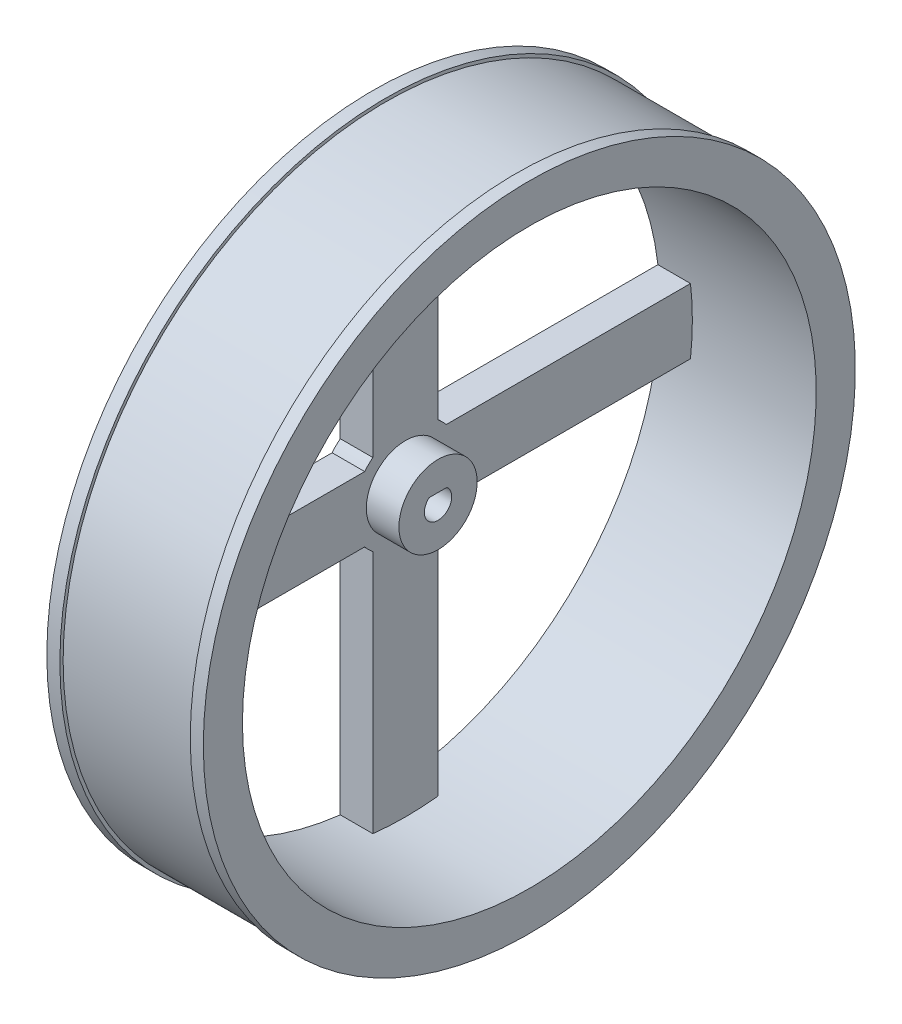
ISO-10303-21;
HEADER;
FILE_DESCRIPTION(('STEP AP214'),'2;1');
FILE_NAME('part.step','',(''),(''),'','','');
FILE_SCHEMA(('AUTOMOTIVE_DESIGN { 1 0 10303 214 1 1 1 1 }'));
ENDSEC;
DATA;
#1=APPLICATION_CONTEXT('core data for automotive mechanical design processes');
#2=APPLICATION_PROTOCOL_DEFINITION('international standard','automotive_design',2000,#1);
#3=PRODUCT_CONTEXT('',#1,'mechanical');
#4=PRODUCT('Part','Part','',(#3));
#5=PRODUCT_RELATED_PRODUCT_CATEGORY('part','',(#4));
#6=PRODUCT_DEFINITION_FORMATION('','',#4);
#7=PRODUCT_DEFINITION_CONTEXT('part definition',#1,'design');
#8=PRODUCT_DEFINITION('design','',#6,#7);
#9=PRODUCT_DEFINITION_SHAPE('','',#8);
#10=(LENGTH_UNIT() NAMED_UNIT(*) SI_UNIT(.MILLI.,.METRE.));
#11=(NAMED_UNIT(*) PLANE_ANGLE_UNIT() SI_UNIT($,.RADIAN.));
#12=(NAMED_UNIT(*) SI_UNIT($,.STERADIAN.) SOLID_ANGLE_UNIT());
#13=UNCERTAINTY_MEASURE_WITH_UNIT(LENGTH_MEASURE(1.E-05),#10,'distance_accuracy_value','');
#14=(GEOMETRIC_REPRESENTATION_CONTEXT(3) GLOBAL_UNCERTAINTY_ASSIGNED_CONTEXT((#13)) GLOBAL_UNIT_ASSIGNED_CONTEXT((#10,
#11,#12)) REPRESENTATION_CONTEXT('',''));
#15=CARTESIAN_POINT('',(0.,0.,0.));
#16=DIRECTION('',(0.,0.,1.));
#17=DIRECTION('',(1.,0.,0.));
#18=AXIS2_PLACEMENT_3D('',#15,#16,#17);
#19=CARTESIAN_POINT('',(0.,0.,0.));
#20=DIRECTION('',(-1.,0.,0.));
#21=DIRECTION('',(0.,0.,1.));
#22=AXIS2_PLACEMENT_3D('',#19,#20,#21);
#23=CYLINDRICAL_SURFACE('',#22,44.);
#24=CARTESIAN_POINT('',(12.,0.,0.));
#25=DIRECTION('',(-1.,0.,0.));
#26=DIRECTION('',(0.,0.,1.));
#27=AXIS2_PLACEMENT_3D('',#24,#25,#26);
#28=CIRCLE('',#27,44.);
#29=CARTESIAN_POINT('',(12.,0.,44.));
#30=VERTEX_POINT('',#29);
#31=EDGE_CURVE('E184',#30,#30,#28,.T.);
#32=ORIENTED_EDGE('',*,*,#31,.F.);
#33=EDGE_LOOP('',(#32));
#34=FACE_BOUND('',#33,.T.);
#35=DIRECTION('',(-1.,0.,0.));
#36=VECTOR('',#35,1.);
#37=CARTESIAN_POINT('',(-7.,-5.00000000000015,-43.7149859887888));
#38=LINE('',#37,#36);
#39=CARTESIAN_POINT('',(-7.,-5.00000000000015,-43.7149859887888));
#40=VERTEX_POINT('',#39);
#41=CARTESIAN_POINT('',(-12.,-5.00000000000015,-43.7149859887888));
#42=VERTEX_POINT('',#41);
#43=EDGE_CURVE('E277',#40,#42,#38,.T.);
#44=ORIENTED_EDGE('',*,*,#43,.T.);
#45=CARTESIAN_POINT('',(-12.,0.,0.));
#46=DIRECTION('',(-1.,0.,0.));
#47=DIRECTION('',(0.,0.,1.));
#48=AXIS2_PLACEMENT_3D('',#45,#46,#47);
#49=CIRCLE('',#48,44.);
#50=CARTESIAN_POINT('',(-12.,-43.7149859887888,-5.));
#51=VERTEX_POINT('',#50);
#52=EDGE_CURVE('E372',#42,#51,#49,.T.);
#53=ORIENTED_EDGE('',*,*,#52,.T.);
#54=DIRECTION('',(-1.,0.,0.));
#55=VECTOR('',#54,1.);
#56=CARTESIAN_POINT('',(-7.,-43.7149859887888,-5.));
#57=LINE('',#56,#55);
#58=CARTESIAN_POINT('',(-7.,-43.7149859887888,-5.));
#59=VERTEX_POINT('',#58);
#60=EDGE_CURVE('E243',#59,#51,#57,.T.);
#61=ORIENTED_EDGE('',*,*,#60,.F.);
#62=CARTESIAN_POINT('',(-7.,0.,0.));
#63=DIRECTION('',(1.,0.,0.));
#64=DIRECTION('',(0.,0.,-1.));
#65=AXIS2_PLACEMENT_3D('',#62,#63,#64);
#66=CIRCLE('',#65,44.);
#67=CARTESIAN_POINT('',(-7.,-43.7149859887888,5.));
#68=VERTEX_POINT('',#67);
#69=EDGE_CURVE('E225',#68,#59,#66,.T.);
#70=ORIENTED_EDGE('',*,*,#69,.F.);
#71=DIRECTION('',(-1.,0.,0.));
#72=VECTOR('',#71,1.);
#73=CARTESIAN_POINT('',(-7.,-43.7149859887888,4.99999999999999));
#74=LINE('',#73,#72);
#75=CARTESIAN_POINT('',(-12.,-43.7149859887888,4.99999999999999));
#76=VERTEX_POINT('',#75);
#77=EDGE_CURVE('E247',#68,#76,#74,.T.);
#78=ORIENTED_EDGE('',*,*,#77,.T.);
#79=CARTESIAN_POINT('',(-12.,-4.99999999999954,43.7149859887888));
#80=VERTEX_POINT('',#79);
#81=EDGE_CURVE('E183',#76,#80,#49,.T.);
#82=ORIENTED_EDGE('',*,*,#81,.T.);
#83=DIRECTION('',(-1.,0.,0.));
#84=VECTOR('',#83,1.);
#85=CARTESIAN_POINT('',(-7.,-4.99999999999955,43.7149859887888));
#86=LINE('',#85,#84);
#87=CARTESIAN_POINT('',(-7.,-4.99999999999955,43.7149859887888));
#88=VERTEX_POINT('',#87);
#89=EDGE_CURVE('E196',#88,#80,#86,.T.);
#90=ORIENTED_EDGE('',*,*,#89,.F.);
#91=CARTESIAN_POINT('',(-7.,0.,0.));
#92=DIRECTION('',(1.,0.,0.));
#93=DIRECTION('',(0.,-1.,0.));
#94=AXIS2_PLACEMENT_3D('',#91,#92,#93);
#95=CIRCLE('',#94,44.);
#96=CARTESIAN_POINT('',(-7.,5.00000000000045,43.7149859887887));
#97=VERTEX_POINT('',#96);
#98=EDGE_CURVE('E190',#97,#88,#95,.T.);
#99=ORIENTED_EDGE('',*,*,#98,.F.);
#100=DIRECTION('',(-1.,0.,0.));
#101=VECTOR('',#100,1.);
#102=CARTESIAN_POINT('',(-7.,5.00000000000045,43.7149859887887));
#103=LINE('',#102,#101);
#104=CARTESIAN_POINT('',(-12.,5.00000000000045,43.7149859887887));
#105=VERTEX_POINT('',#104);
#106=EDGE_CURVE('E188',#97,#105,#103,.T.);
#107=ORIENTED_EDGE('',*,*,#106,.T.);
#108=CARTESIAN_POINT('',(-12.,43.7149859887888,5.));
#109=VERTEX_POINT('',#108);
#110=EDGE_CURVE('E172',#105,#109,#49,.T.);
#111=ORIENTED_EDGE('',*,*,#110,.T.);
#112=DIRECTION('',(-1.,0.,0.));
#113=VECTOR('',#112,1.);
#114=CARTESIAN_POINT('',(-7.,43.7149859887888,5.));
#115=LINE('',#114,#113);
#116=CARTESIAN_POINT('',(-7.,43.7149859887888,5.));
#117=VERTEX_POINT('',#116);
#118=EDGE_CURVE('E338',#117,#109,#115,.T.);
#119=ORIENTED_EDGE('',*,*,#118,.F.);
#120=CARTESIAN_POINT('',(-7.,0.,0.));
#121=DIRECTION('',(1.,0.,0.));
#122=DIRECTION('',(0.,0.,1.));
#123=AXIS2_PLACEMENT_3D('',#120,#121,#122);
#124=CIRCLE('',#123,44.);
#125=CARTESIAN_POINT('',(-7.,43.7149859887888,-5.));
#126=VERTEX_POINT('',#125);
#127=EDGE_CURVE('E317',#126,#117,#124,.T.);
#128=ORIENTED_EDGE('',*,*,#127,.F.);
#129=DIRECTION('',(-1.,0.,0.));
#130=VECTOR('',#129,1.);
#131=CARTESIAN_POINT('',(-7.,43.7149859887888,-4.99999999999999));
#132=LINE('',#131,#130);
#133=CARTESIAN_POINT('',(-12.,43.7149859887888,-5.));
#134=VERTEX_POINT('',#133);
#135=EDGE_CURVE('E341',#126,#134,#132,.T.);
#136=ORIENTED_EDGE('',*,*,#135,.T.);
#137=CARTESIAN_POINT('',(-12.,4.99999999999985,-43.7149859887888));
#138=VERTEX_POINT('',#137);
#139=EDGE_CURVE('E186',#134,#138,#49,.T.);
#140=ORIENTED_EDGE('',*,*,#139,.T.);
#141=DIRECTION('',(-1.,0.,0.));
#142=VECTOR('',#141,1.);
#143=CARTESIAN_POINT('',(-7.,4.99999999999985,-43.7149859887888));
#144=LINE('',#143,#142);
#145=CARTESIAN_POINT('',(-7.,4.99999999999985,-43.7149859887888));
#146=VERTEX_POINT('',#145);
#147=EDGE_CURVE('E68',#146,#138,#144,.T.);
#148=ORIENTED_EDGE('',*,*,#147,.F.);
#149=CARTESIAN_POINT('',(-7.,0.,0.));
#150=DIRECTION('',(1.,0.,0.));
#151=DIRECTION('',(0.,1.,0.));
#152=AXIS2_PLACEMENT_3D('',#149,#150,#151);
#153=CIRCLE('',#152,44.);
#154=EDGE_CURVE('E63',#40,#146,#153,.T.);
#155=ORIENTED_EDGE('',*,*,#154,.F.);
#156=EDGE_LOOP('',(#44,#53,#61,#70,#78,#82,#90,#99,#107,#111,#119,#128,#136,#140,#148,#155));
#157=FACE_BOUND('',#156,.T.);
#158=ADVANCED_FACE('F47',(#34,#157),#23,.F.);
#159=CARTESIAN_POINT('',(-7.,0.,0.));
#160=DIRECTION('',(-1.,0.,0.));
#161=DIRECTION('',(0.,0.,1.));
#162=AXIS2_PLACEMENT_3D('',#159,#160,#161);
#163=CYLINDRICAL_SURFACE('',#162,8.);
#164=DIRECTION('',(-1.,0.,0.));
#165=VECTOR('',#164,1.);
#166=CARTESIAN_POINT('',(-7.,-5.00000000000002,-6.24499799839838));
#167=LINE('',#166,#165);
#168=CARTESIAN_POINT('',(-7.,-5.00000000000002,-6.24499799839838));
#169=VERTEX_POINT('',#168);
#170=CARTESIAN_POINT('',(-12.,-5.00000000000002,-6.24499799839838));
#171=VERTEX_POINT('',#170);
#172=EDGE_CURVE('E280',#169,#171,#167,.T.);
#173=ORIENTED_EDGE('',*,*,#172,.F.);
#174=CARTESIAN_POINT('',(-7.,0.,0.));
#175=DIRECTION('',(1.,0.,0.));
#176=DIRECTION('',(0.,0.,-1.));
#177=AXIS2_PLACEMENT_3D('',#174,#175,#176);
#178=CIRCLE('',#177,8.);
#179=CARTESIAN_POINT('',(-7.,-6.2449979983984,-5.));
#180=VERTEX_POINT('',#179);
#181=EDGE_CURVE('E512',#180,#169,#178,.T.);
#182=ORIENTED_EDGE('',*,*,#181,.F.);
#183=DIRECTION('',(-1.,0.,0.));
#184=VECTOR('',#183,1.);
#185=CARTESIAN_POINT('',(-7.,-6.2449979983984,-5.));
#186=LINE('',#185,#184);
#187=CARTESIAN_POINT('',(-12.,-6.2449979983984,-5.));
#188=VERTEX_POINT('',#187);
#189=EDGE_CURVE('E234',#180,#188,#186,.T.);
#190=ORIENTED_EDGE('',*,*,#189,.T.);
#191=CARTESIAN_POINT('',(-12.,0.,0.));
#192=DIRECTION('',(1.,0.,0.));
#193=DIRECTION('',(0.,0.,-1.));
#194=AXIS2_PLACEMENT_3D('',#191,#192,#193);
#195=CIRCLE('',#194,8.);
#196=EDGE_CURVE('E497',#188,#171,#195,.T.);
#197=ORIENTED_EDGE('',*,*,#196,.T.);
#198=EDGE_LOOP('',(#173,#182,#190,#197));
#199=FACE_BOUND('',#198,.T.);
#200=ADVANCED_FACE('F435',(#199),#163,.T.);
#201=DIRECTION('',(-1.,0.,0.));
#202=VECTOR('',#201,1.);
#203=CARTESIAN_POINT('',(-7.,4.99999999999998,-6.24499799839841));
#204=LINE('',#203,#202);
#205=CARTESIAN_POINT('',(-7.,4.99999999999998,-6.24499799839841));
#206=VERTEX_POINT('',#205);
#207=CARTESIAN_POINT('',(-12.,4.99999999999998,-6.24499799839841));
#208=VERTEX_POINT('',#207);
#209=EDGE_CURVE('E266',#206,#208,#204,.T.);
#210=ORIENTED_EDGE('',*,*,#209,.T.);
#211=CARTESIAN_POINT('',(-12.,6.2449979983984,-5.));
#212=VERTEX_POINT('',#211);
#213=EDGE_CURVE('E306',#208,#212,#195,.T.);
#214=ORIENTED_EDGE('',*,*,#213,.T.);
#215=DIRECTION('',(-1.,0.,0.));
#216=VECTOR('',#215,1.);
#217=CARTESIAN_POINT('',(-7.,6.2449979983984,-5.));
#218=LINE('',#217,#216);
#219=CARTESIAN_POINT('',(-7.,6.2449979983984,-5.));
#220=VERTEX_POINT('',#219);
#221=EDGE_CURVE('E343',#220,#212,#218,.T.);
#222=ORIENTED_EDGE('',*,*,#221,.F.);
#223=EDGE_CURVE('E313',#206,#220,#178,.T.);
#224=ORIENTED_EDGE('',*,*,#223,.F.);
#225=EDGE_LOOP('',(#210,#214,#222,#224));
#226=FACE_BOUND('',#225,.T.);
#227=ADVANCED_FACE('F439',(#226),#163,.T.);
#228=DIRECTION('',(-1.,0.,0.));
#229=VECTOR('',#228,1.);
#230=CARTESIAN_POINT('',(-7.,-4.99999999999994,6.24499799839845));
#231=LINE('',#230,#229);
#232=CARTESIAN_POINT('',(-7.,-4.99999999999994,6.24499799839845));
#233=VERTEX_POINT('',#232);
#234=CARTESIAN_POINT('',(-12.,-4.99999999999994,6.24499799839845));
#235=VERTEX_POINT('',#234);
#236=EDGE_CURVE('E212',#233,#235,#231,.T.);
#237=ORIENTED_EDGE('',*,*,#236,.T.);
#238=CARTESIAN_POINT('',(-12.,-6.2449979983984,5.));
#239=VERTEX_POINT('',#238);
#240=EDGE_CURVE('E329',#235,#239,#195,.T.);
#241=ORIENTED_EDGE('',*,*,#240,.T.);
#242=DIRECTION('',(-1.,0.,0.));
#243=VECTOR('',#242,1.);
#244=CARTESIAN_POINT('',(-7.,-6.2449979983984,5.));
#245=LINE('',#244,#243);
#246=CARTESIAN_POINT('',(-7.,-6.2449979983984,5.));
#247=VERTEX_POINT('',#246);
#248=EDGE_CURVE('E251',#247,#239,#245,.T.);
#249=ORIENTED_EDGE('',*,*,#248,.F.);
#250=EDGE_CURVE('E312',#233,#247,#178,.T.);
#251=ORIENTED_EDGE('',*,*,#250,.F.);
#252=EDGE_LOOP('',(#237,#241,#249,#251));
#253=FACE_BOUND('',#252,.T.);
#254=ADVANCED_FACE('F526',(#253),#163,.T.);
#255=DIRECTION('',(-1.,0.,0.));
#256=VECTOR('',#255,1.);
#257=CARTESIAN_POINT('',(-7.,5.00000000000006,6.24499799839835));
#258=LINE('',#257,#256);
#259=CARTESIAN_POINT('',(-7.,5.00000000000006,6.24499799839835));
#260=VERTEX_POINT('',#259);
#261=CARTESIAN_POINT('',(-12.,5.00000000000006,6.24499799839835));
#262=VERTEX_POINT('',#261);
#263=EDGE_CURVE('E195',#260,#262,#258,.T.);
#264=ORIENTED_EDGE('',*,*,#263,.F.);
#265=CARTESIAN_POINT('',(-7.,6.2449979983984,5.));
#266=VERTEX_POINT('',#265);
#267=EDGE_CURVE('E307',#266,#260,#178,.T.);
#268=ORIENTED_EDGE('',*,*,#267,.F.);
#269=DIRECTION('',(-1.,0.,0.));
#270=VECTOR('',#269,1.);
#271=CARTESIAN_POINT('',(-7.,6.2449979983984,5.));
#272=LINE('',#271,#270);
#273=CARTESIAN_POINT('',(-12.,6.2449979983984,5.));
#274=VERTEX_POINT('',#273);
#275=EDGE_CURVE('E324',#266,#274,#272,.T.);
#276=ORIENTED_EDGE('',*,*,#275,.T.);
#277=EDGE_CURVE('E325',#274,#262,#195,.T.);
#278=ORIENTED_EDGE('',*,*,#277,.T.);
#279=EDGE_LOOP('',(#264,#268,#276,#278));
#280=FACE_BOUND('',#279,.T.);
#281=ADVANCED_FACE('F401',(#280),#163,.T.);
#282=CARTESIAN_POINT('',(0.,0.,0.));
#283=DIRECTION('',(-1.,0.,0.));
#284=DIRECTION('',(0.,0.,1.));
#285=AXIS2_PLACEMENT_3D('',#282,#283,#284);
#286=CYLINDRICAL_SURFACE('',#285,50.);
#287=CARTESIAN_POINT('',(-12.,0.,0.));
#288=DIRECTION('',(-1.,0.,0.));
#289=DIRECTION('',(0.,0.,1.));
#290=AXIS2_PLACEMENT_3D('',#287,#288,#289);
#291=CIRCLE('',#290,50.);
#292=CARTESIAN_POINT('',(-12.,0.,50.));
#293=VERTEX_POINT('',#292);
#294=EDGE_CURVE('E371',#293,#293,#291,.T.);
#295=ORIENTED_EDGE('',*,*,#294,.F.);
#296=EDGE_LOOP('',(#295));
#297=FACE_BOUND('',#296,.T.);
#298=CARTESIAN_POINT('',(-10.,0.,0.));
#299=DIRECTION('',(-1.,0.,0.));
#300=DIRECTION('',(0.,0.,1.));
#301=AXIS2_PLACEMENT_3D('',#298,#299,#300);
#302=CIRCLE('',#301,50.);
#303=CARTESIAN_POINT('',(-10.,0.,50.));
#304=VERTEX_POINT('',#303);
#305=EDGE_CURVE('E347',#304,#304,#302,.T.);
#306=ORIENTED_EDGE('',*,*,#305,.T.);
#307=EDGE_LOOP('',(#306));
#308=FACE_BOUND('',#307,.T.);
#309=ADVANCED_FACE('F49',(#297,#308),#286,.T.);
#310=CARTESIAN_POINT('',(-12.,50.,0.));
#311=DIRECTION('',(1.,0.,0.));
#312=DIRECTION('',(0.,0.,-1.));
#313=AXIS2_PLACEMENT_3D('',#310,#311,#312);
#314=PLANE('',#313);
#315=DIRECTION('',(0.,1.,0.));
#316=VECTOR('',#315,1.);
#317=CARTESIAN_POINT('',(-12.,6.2449979983984,-5.));
#318=LINE('',#317,#316);
#319=EDGE_CURVE('E328',#212,#134,#318,.T.);
#320=ORIENTED_EDGE('',*,*,#319,.F.);
#321=ORIENTED_EDGE('',*,*,#213,.F.);
#322=DIRECTION('',(0.,0.,1.));
#323=VECTOR('',#322,1.);
#324=CARTESIAN_POINT('',(-12.,4.99999999999998,-6.24499799839841));
#325=LINE('',#324,#323);
#326=EDGE_CURVE('E259',#138,#208,#325,.T.);
#327=ORIENTED_EDGE('',*,*,#326,.F.);
#328=ORIENTED_EDGE('',*,*,#139,.F.);
#329=EDGE_LOOP('',(#320,#321,#327,#328));
#330=FACE_BOUND('',#329,.T.);
#331=ORIENTED_EDGE('',*,*,#277,.F.);
#332=DIRECTION('',(0.,-1.,0.));
#333=VECTOR('',#332,1.);
#334=CARTESIAN_POINT('',(-12.,6.2449979983984,5.));
#335=LINE('',#334,#333);
#336=EDGE_CURVE('E180',#109,#274,#335,.T.);
#337=ORIENTED_EDGE('',*,*,#336,.F.);
#338=ORIENTED_EDGE('',*,*,#110,.F.);
#339=DIRECTION('',(0.,0.,1.));
#340=VECTOR('',#339,1.);
#341=CARTESIAN_POINT('',(-12.,5.00000000000006,6.24499799839835));
#342=LINE('',#341,#340);
#343=EDGE_CURVE('E178',#262,#105,#342,.T.);
#344=ORIENTED_EDGE('',*,*,#343,.F.);
#345=EDGE_LOOP('',(#331,#337,#338,#344));
#346=FACE_BOUND('',#345,.T.);
#347=DIRECTION('',(0.,0.,1.));
#348=VECTOR('',#347,1.);
#349=CARTESIAN_POINT('',(-12.,1.6,1.36014705087354));
#350=LINE('',#349,#348);
#351=CARTESIAN_POINT('',(-12.,1.6,-1.36014705087354));
#352=VERTEX_POINT('',#351);
#353=CARTESIAN_POINT('',(-12.,1.6,1.36014705087354));
#354=VERTEX_POINT('',#353);
#355=EDGE_CURVE('E288',#352,#354,#350,.T.);
#356=ORIENTED_EDGE('',*,*,#355,.T.);
#357=CARTESIAN_POINT('',(-12.,0.,0.));
#358=DIRECTION('',(1.,0.,0.));
#359=DIRECTION('',(0.,0.,-1.));
#360=AXIS2_PLACEMENT_3D('',#357,#358,#359);
#361=CIRCLE('',#360,2.1);
#362=EDGE_CURVE('E284',#354,#352,#361,.T.);
#363=ORIENTED_EDGE('',*,*,#362,.T.);
#364=EDGE_LOOP('',(#356,#363));
#365=FACE_BOUND('',#364,.T.);
#366=DIRECTION('',(0.,0.,-1.));
#367=VECTOR('',#366,1.);
#368=CARTESIAN_POINT('',(-12.,-4.99999999999994,6.24499799839845));
#369=LINE('',#368,#367);
#370=EDGE_CURVE('E200',#80,#235,#369,.T.);
#371=ORIENTED_EDGE('',*,*,#370,.F.);
#372=ORIENTED_EDGE('',*,*,#81,.F.);
#373=DIRECTION('',(0.,-1.,0.));
#374=VECTOR('',#373,1.);
#375=CARTESIAN_POINT('',(-12.,-6.2449979983984,5.));
#376=LINE('',#375,#374);
#377=EDGE_CURVE('E220',#239,#76,#376,.T.);
#378=ORIENTED_EDGE('',*,*,#377,.F.);
#379=ORIENTED_EDGE('',*,*,#240,.F.);
#380=EDGE_LOOP('',(#371,#372,#378,#379));
#381=FACE_BOUND('',#380,.T.);
#382=ORIENTED_EDGE('',*,*,#52,.F.);
#383=DIRECTION('',(0.,0.,-1.));
#384=VECTOR('',#383,1.);
#385=CARTESIAN_POINT('',(-12.,-5.00000000000002,-6.24499799839838));
#386=LINE('',#385,#384);
#387=EDGE_CURVE('E255',#171,#42,#386,.T.);
#388=ORIENTED_EDGE('',*,*,#387,.F.);
#389=ORIENTED_EDGE('',*,*,#196,.F.);
#390=DIRECTION('',(0.,1.,0.));
#391=VECTOR('',#390,1.);
#392=CARTESIAN_POINT('',(-12.,-6.2449979983984,-5.));
#393=LINE('',#392,#391);
#394=EDGE_CURVE('E226',#51,#188,#393,.T.);
#395=ORIENTED_EDGE('',*,*,#394,.F.);
#396=EDGE_LOOP('',(#382,#388,#389,#395));
#397=FACE_BOUND('',#396,.T.);
#398=ORIENTED_EDGE('',*,*,#294,.T.);
#399=EDGE_LOOP('',(#398));
#400=FACE_BOUND('',#399,.T.);
#401=ADVANCED_FACE('F175',(#330,#346,#365,#381,#397,#400),#314,.F.);
#402=CARTESIAN_POINT('',(12.,44.,0.));
#403=DIRECTION('',(-1.,0.,0.));
#404=DIRECTION('',(0.,0.,1.));
#405=AXIS2_PLACEMENT_3D('',#402,#403,#404);
#406=PLANE('',#405);
#407=CARTESIAN_POINT('',(12.,0.,0.));
#408=DIRECTION('',(-1.,0.,0.));
#409=DIRECTION('',(0.,0.,1.));
#410=AXIS2_PLACEMENT_3D('',#407,#408,#409);
#411=CIRCLE('',#410,50.);
#412=CARTESIAN_POINT('',(12.,0.,50.));
#413=VERTEX_POINT('',#412);
#414=EDGE_CURVE('E363',#413,#413,#411,.T.);
#415=ORIENTED_EDGE('',*,*,#414,.F.);
#416=EDGE_LOOP('',(#415));
#417=FACE_BOUND('',#416,.T.);
#418=ORIENTED_EDGE('',*,*,#31,.T.);
#419=EDGE_LOOP('',(#418));
#420=FACE_BOUND('',#419,.T.);
#421=ADVANCED_FACE('F389',(#417,#420),#406,.F.);
#422=CARTESIAN_POINT('',(0.,0.,0.));
#423=DIRECTION('',(-1.,0.,0.));
#424=DIRECTION('',(0.,0.,1.));
#425=AXIS2_PLACEMENT_3D('',#422,#423,#424);
#426=CYLINDRICAL_SURFACE('',#425,50.);
#427=CARTESIAN_POINT('',(10.,0.,0.));
#428=DIRECTION('',(-1.,0.,0.));
#429=DIRECTION('',(0.,0.,1.));
#430=AXIS2_PLACEMENT_3D('',#427,#428,#429);
#431=CIRCLE('',#430,50.);
#432=CARTESIAN_POINT('',(10.,0.,50.));
#433=VERTEX_POINT('',#432);
#434=EDGE_CURVE('E359',#433,#433,#431,.T.);
#435=ORIENTED_EDGE('',*,*,#434,.F.);
#436=EDGE_LOOP('',(#435));
#437=FACE_BOUND('',#436,.T.);
#438=ORIENTED_EDGE('',*,*,#414,.T.);
#439=EDGE_LOOP('',(#438));
#440=FACE_BOUND('',#439,.T.);
#441=ADVANCED_FACE('F420',(#437,#440),#426,.T.);
#442=CARTESIAN_POINT('',(10.,50.,0.));
#443=DIRECTION('',(1.,0.,0.));
#444=DIRECTION('',(0.,0.,-1.));
#445=AXIS2_PLACEMENT_3D('',#442,#443,#444);
#446=PLANE('',#445);
#447=CARTESIAN_POINT('',(10.,0.,0.));
#448=DIRECTION('',(-1.,0.,0.));
#449=DIRECTION('',(0.,0.,1.));
#450=AXIS2_PLACEMENT_3D('',#447,#448,#449);
#451=CIRCLE('',#450,49.5);
#452=CARTESIAN_POINT('',(10.,0.,49.5));
#453=VERTEX_POINT('',#452);
#454=EDGE_CURVE('E355',#453,#453,#451,.T.);
#455=ORIENTED_EDGE('',*,*,#454,.F.);
#456=EDGE_LOOP('',(#455));
#457=FACE_BOUND('',#456,.T.);
#458=ORIENTED_EDGE('',*,*,#434,.T.);
#459=EDGE_LOOP('',(#458));
#460=FACE_BOUND('',#459,.T.);
#461=ADVANCED_FACE('F414',(#457,#460),#446,.F.);
#462=CARTESIAN_POINT('',(0.,0.,0.));
#463=DIRECTION('',(-1.,0.,0.));
#464=DIRECTION('',(0.,0.,1.));
#465=AXIS2_PLACEMENT_3D('',#462,#463,#464);
#466=CYLINDRICAL_SURFACE('',#465,49.5);
#467=CARTESIAN_POINT('',(-10.,0.,0.));
#468=DIRECTION('',(-1.,0.,0.));
#469=DIRECTION('',(0.,0.,1.));
#470=AXIS2_PLACEMENT_3D('',#467,#468,#469);
#471=CIRCLE('',#470,49.5);
#472=CARTESIAN_POINT('',(-10.,0.,49.5));
#473=VERTEX_POINT('',#472);
#474=EDGE_CURVE('E351',#473,#473,#471,.T.);
#475=ORIENTED_EDGE('',*,*,#474,.F.);
#476=EDGE_LOOP('',(#475));
#477=FACE_BOUND('',#476,.T.);
#478=ORIENTED_EDGE('',*,*,#454,.T.);
#479=EDGE_LOOP('',(#478));
#480=FACE_BOUND('',#479,.T.);
#481=ADVANCED_FACE('F408',(#477,#480),#466,.T.);
#482=CARTESIAN_POINT('',(-10.,49.5,0.));
#483=DIRECTION('',(-1.,0.,0.));
#484=DIRECTION('',(0.,0.,1.));
#485=AXIS2_PLACEMENT_3D('',#482,#483,#484);
#486=PLANE('',#485);
#487=ORIENTED_EDGE('',*,*,#305,.F.);
#488=EDGE_LOOP('',(#487));
#489=FACE_BOUND('',#488,.T.);
#490=ORIENTED_EDGE('',*,*,#474,.T.);
#491=EDGE_LOOP('',(#490));
#492=FACE_BOUND('',#491,.T.);
#493=ADVANCED_FACE('F404',(#489,#492),#486,.F.);
#494=CARTESIAN_POINT('',(-7.,0.,0.));
#495=DIRECTION('',(1.,0.,0.));
#496=DIRECTION('',(0.,0.,-1.));
#497=AXIS2_PLACEMENT_3D('',#494,#495,#496);
#498=PLANE('',#497);
#499=ORIENTED_EDGE('',*,*,#223,.T.);
#500=DIRECTION('',(0.,1.,0.));
#501=VECTOR('',#500,1.);
#502=CARTESIAN_POINT('',(-7.,6.2449979983984,-5.));
#503=LINE('',#502,#501);
#504=EDGE_CURVE('E311',#220,#126,#503,.T.);
#505=ORIENTED_EDGE('',*,*,#504,.T.);
#506=ORIENTED_EDGE('',*,*,#127,.T.);
#507=DIRECTION('',(0.,-1.,0.));
#508=VECTOR('',#507,1.);
#509=CARTESIAN_POINT('',(-7.,6.2449979983984,5.));
#510=LINE('',#509,#508);
#511=EDGE_CURVE('E321',#117,#266,#510,.T.);
#512=ORIENTED_EDGE('',*,*,#511,.T.);
#513=ORIENTED_EDGE('',*,*,#267,.T.);
#514=DIRECTION('',(0.,0.,1.));
#515=VECTOR('',#514,1.);
#516=CARTESIAN_POINT('',(-7.,5.00000000000006,6.24499799839835));
#517=LINE('',#516,#515);
#518=EDGE_CURVE('E206',#260,#97,#517,.T.);
#519=ORIENTED_EDGE('',*,*,#518,.T.);
#520=ORIENTED_EDGE('',*,*,#98,.T.);
#521=DIRECTION('',(0.,0.,-1.));
#522=VECTOR('',#521,1.);
#523=CARTESIAN_POINT('',(-7.,-4.99999999999994,6.24499799839845));
#524=LINE('',#523,#522);
#525=EDGE_CURVE('E209',#88,#233,#524,.T.);
#526=ORIENTED_EDGE('',*,*,#525,.T.);
#527=ORIENTED_EDGE('',*,*,#250,.T.);
#528=DIRECTION('',(0.,-1.,0.));
#529=VECTOR('',#528,1.);
#530=CARTESIAN_POINT('',(-7.,-6.2449979983984,5.));
#531=LINE('',#530,#529);
#532=EDGE_CURVE('E221',#247,#68,#531,.T.);
#533=ORIENTED_EDGE('',*,*,#532,.T.);
#534=ORIENTED_EDGE('',*,*,#69,.T.);
#535=DIRECTION('',(0.,1.,0.));
#536=VECTOR('',#535,1.);
#537=CARTESIAN_POINT('',(-7.,-6.2449979983984,-5.));
#538=LINE('',#537,#536);
#539=EDGE_CURVE('E230',#59,#180,#538,.T.);
#540=ORIENTED_EDGE('',*,*,#539,.T.);
#541=ORIENTED_EDGE('',*,*,#181,.T.);
#542=DIRECTION('',(0.,0.,-1.));
#543=VECTOR('',#542,1.);
#544=CARTESIAN_POINT('',(-7.,-5.00000000000002,-6.24499799839838));
#545=LINE('',#544,#543);
#546=EDGE_CURVE('E256',#169,#40,#545,.T.);
#547=ORIENTED_EDGE('',*,*,#546,.T.);
#548=ORIENTED_EDGE('',*,*,#154,.T.);
#549=DIRECTION('',(0.,0.,1.));
#550=VECTOR('',#549,1.);
#551=CARTESIAN_POINT('',(-7.,4.99999999999998,-6.24499799839841));
#552=LINE('',#551,#550);
#553=EDGE_CURVE('E262',#146,#206,#552,.T.);
#554=ORIENTED_EDGE('',*,*,#553,.T.);
#555=EDGE_LOOP('',(#499,#505,#506,#512,#513,#519,#520,#526,#527,#533,#534,#540,#541,#547,#548,#554));
#556=FACE_BOUND('',#555,.T.);
#557=CARTESIAN_POINT('',(-7.,0.,0.));
#558=DIRECTION('',(1.,0.,0.));
#559=DIRECTION('',(0.,0.,-1.));
#560=AXIS2_PLACEMENT_3D('',#557,#558,#559);
#561=CIRCLE('',#560,6.);
#562=CARTESIAN_POINT('',(-7.,0.,-6.));
#563=VERTEX_POINT('',#562);
#564=EDGE_CURVE('E302',#563,#563,#561,.T.);
#565=ORIENTED_EDGE('',*,*,#564,.F.);
#566=EDGE_LOOP('',(#565));
#567=FACE_BOUND('',#566,.T.);
#568=ADVANCED_FACE('F407',(#556,#567),#498,.T.);
#569=CARTESIAN_POINT('',(-7.,6.2449979983984,-5.));
#570=DIRECTION('',(0.,0.,1.));
#571=DIRECTION('',(0.,-1.,0.));
#572=AXIS2_PLACEMENT_3D('',#569,#570,#571);
#573=PLANE('',#572);
#574=ORIENTED_EDGE('',*,*,#319,.T.);
#575=ORIENTED_EDGE('',*,*,#135,.F.);
#576=ORIENTED_EDGE('',*,*,#504,.F.);
#577=ORIENTED_EDGE('',*,*,#221,.T.);
#578=EDGE_LOOP('',(#574,#575,#576,#577));
#579=FACE_BOUND('',#578,.T.);
#580=ADVANCED_FACE('F443',(#579),#573,.F.);
#581=CARTESIAN_POINT('',(-7.,6.2449979983984,5.));
#582=DIRECTION('',(0.,0.,-1.));
#583=DIRECTION('',(0.,1.,0.));
#584=AXIS2_PLACEMENT_3D('',#581,#582,#583);
#585=PLANE('',#584);
#586=ORIENTED_EDGE('',*,*,#336,.T.);
#587=ORIENTED_EDGE('',*,*,#275,.F.);
#588=ORIENTED_EDGE('',*,*,#511,.F.);
#589=ORIENTED_EDGE('',*,*,#118,.T.);
#590=EDGE_LOOP('',(#586,#587,#588,#589));
#591=FACE_BOUND('',#590,.T.);
#592=ADVANCED_FACE('F446',(#591),#585,.F.);
#593=CARTESIAN_POINT('',(-1.99999999999997,0.,0.));
#594=DIRECTION('',(-1.,0.,0.));
#595=DIRECTION('',(0.,0.,1.));
#596=AXIS2_PLACEMENT_3D('',#593,#594,#595);
#597=PLANE('',#596);
#598=DIRECTION('',(0.,0.,-1.));
#599=VECTOR('',#598,1.);
#600=CARTESIAN_POINT('',(-1.99999999999997,1.6,0.));
#601=LINE('',#600,#599);
#602=CARTESIAN_POINT('',(-1.99999999999997,1.6,1.36014705087354));
#603=VERTEX_POINT('',#602);
#604=CARTESIAN_POINT('',(-1.99999999999997,1.6,-1.36014705087354));
#605=VERTEX_POINT('',#604);
#606=EDGE_CURVE('E56',#603,#605,#601,.T.);
#607=ORIENTED_EDGE('',*,*,#606,.T.);
#608=CARTESIAN_POINT('',(-1.99999999999997,0.,0.));
#609=DIRECTION('',(-1.,0.,0.));
#610=DIRECTION('',(0.,0.,1.));
#611=AXIS2_PLACEMENT_3D('',#608,#609,#610);
#612=CIRCLE('',#611,2.1);
#613=EDGE_CURVE('E11',#605,#603,#612,.T.);
#614=ORIENTED_EDGE('',*,*,#613,.T.);
#615=EDGE_LOOP('',(#607,#614));
#616=FACE_BOUND('',#615,.T.);
#617=CARTESIAN_POINT('',(-1.99999999999997,0.,0.));
#618=DIRECTION('',(-1.,0.,0.));
#619=DIRECTION('',(0.,0.,1.));
#620=AXIS2_PLACEMENT_3D('',#617,#618,#619);
#621=CIRCLE('',#620,6.);
#622=CARTESIAN_POINT('',(-1.99999999999997,0.,6.));
#623=VERTEX_POINT('',#622);
#624=EDGE_CURVE('E297',#623,#623,#621,.T.);
#625=ORIENTED_EDGE('',*,*,#624,.F.);
#626=EDGE_LOOP('',(#625));
#627=FACE_BOUND('',#626,.T.);
#628=ADVANCED_FACE('F378',(#616,#627),#597,.F.);
#629=CARTESIAN_POINT('',(0.,0.,0.));
#630=DIRECTION('',(-1.,0.,0.));
#631=DIRECTION('',(0.,0.,1.));
#632=AXIS2_PLACEMENT_3D('',#629,#630,#631);
#633=CYLINDRICAL_SURFACE('',#632,6.);
#634=ORIENTED_EDGE('',*,*,#564,.T.);
#635=EDGE_LOOP('',(#634));
#636=FACE_BOUND('',#635,.T.);
#637=ORIENTED_EDGE('',*,*,#624,.T.);
#638=EDGE_LOOP('',(#637));
#639=FACE_BOUND('',#638,.T.);
#640=ADVANCED_FACE('F456',(#636,#639),#633,.T.);
#641=CARTESIAN_POINT('',(-12.,0.,0.));
#642=DIRECTION('',(1.,0.,0.));
#643=DIRECTION('',(0.,0.,-1.));
#644=AXIS2_PLACEMENT_3D('',#641,#642,#643);
#645=CYLINDRICAL_SURFACE('',#644,2.1);
#646=DIRECTION('',(1.,0.,0.));
#647=VECTOR('',#646,1.);
#648=CARTESIAN_POINT('',(-12.,1.6,-1.36014705087354));
#649=LINE('',#648,#647);
#650=EDGE_CURVE('E292',#352,#605,#649,.T.);
#651=ORIENTED_EDGE('',*,*,#650,.F.);
#652=ORIENTED_EDGE('',*,*,#362,.F.);
#653=DIRECTION('',(1.,0.,0.));
#654=VECTOR('',#653,1.);
#655=CARTESIAN_POINT('',(-12.,1.6,1.36014705087354));
#656=LINE('',#655,#654);
#657=EDGE_CURVE('E293',#354,#603,#656,.T.);
#658=ORIENTED_EDGE('',*,*,#657,.T.);
#659=ORIENTED_EDGE('',*,*,#613,.F.);
#660=EDGE_LOOP('',(#651,#652,#658,#659));
#661=FACE_BOUND('',#660,.T.);
#662=ADVANCED_FACE('F386',(#661),#645,.F.);
#663=CARTESIAN_POINT('',(-12.,1.6,1.36014705087354));
#664=DIRECTION('',(0.,1.,0.));
#665=DIRECTION('',(0.,0.,1.));
#666=AXIS2_PLACEMENT_3D('',#663,#664,#665);
#667=PLANE('',#666);
#668=ORIENTED_EDGE('',*,*,#657,.F.);
#669=ORIENTED_EDGE('',*,*,#355,.F.);
#670=ORIENTED_EDGE('',*,*,#650,.T.);
#671=ORIENTED_EDGE('',*,*,#606,.F.);
#672=EDGE_LOOP('',(#668,#669,#670,#671));
#673=FACE_BOUND('',#672,.T.);
#674=ADVANCED_FACE('F383',(#673),#667,.F.);
#675=CARTESIAN_POINT('',(-7.,-6.2449979983984,-5.));
#676=DIRECTION('',(0.,0.,1.));
#677=DIRECTION('',(0.,-1.,0.));
#678=AXIS2_PLACEMENT_3D('',#675,#676,#677);
#679=PLANE('',#678);
#680=ORIENTED_EDGE('',*,*,#394,.T.);
#681=ORIENTED_EDGE('',*,*,#189,.F.);
#682=ORIENTED_EDGE('',*,*,#539,.F.);
#683=ORIENTED_EDGE('',*,*,#60,.T.);
#684=EDGE_LOOP('',(#680,#681,#682,#683));
#685=FACE_BOUND('',#684,.T.);
#686=ADVANCED_FACE('F464',(#685),#679,.F.);
#687=CARTESIAN_POINT('',(-7.,-6.2449979983984,5.));
#688=DIRECTION('',(0.,0.,-1.));
#689=DIRECTION('',(0.,1.,0.));
#690=AXIS2_PLACEMENT_3D('',#687,#688,#689);
#691=PLANE('',#690);
#692=ORIENTED_EDGE('',*,*,#377,.T.);
#693=ORIENTED_EDGE('',*,*,#77,.F.);
#694=ORIENTED_EDGE('',*,*,#532,.F.);
#695=ORIENTED_EDGE('',*,*,#248,.T.);
#696=EDGE_LOOP('',(#692,#693,#694,#695));
#697=FACE_BOUND('',#696,.T.);
#698=ADVANCED_FACE('F473',(#697),#691,.F.);
#699=CARTESIAN_POINT('',(-7.,-4.99999999999994,6.24499799839845));
#700=DIRECTION('',(0.,1.,0.));
#701=DIRECTION('',(0.,0.,1.));
#702=AXIS2_PLACEMENT_3D('',#699,#700,#701);
#703=PLANE('',#702);
#704=ORIENTED_EDGE('',*,*,#370,.T.);
#705=ORIENTED_EDGE('',*,*,#236,.F.);
#706=ORIENTED_EDGE('',*,*,#525,.F.);
#707=ORIENTED_EDGE('',*,*,#89,.T.);
#708=EDGE_LOOP('',(#704,#705,#706,#707));
#709=FACE_BOUND('',#708,.T.);
#710=ADVANCED_FACE('F476',(#709),#703,.F.);
#711=CARTESIAN_POINT('',(-7.,5.00000000000006,6.24499799839835));
#712=DIRECTION('',(0.,-1.,0.));
#713=DIRECTION('',(0.,0.,-1.));
#714=AXIS2_PLACEMENT_3D('',#711,#712,#713);
#715=PLANE('',#714);
#716=ORIENTED_EDGE('',*,*,#343,.T.);
#717=ORIENTED_EDGE('',*,*,#106,.F.);
#718=ORIENTED_EDGE('',*,*,#518,.F.);
#719=ORIENTED_EDGE('',*,*,#263,.T.);
#720=EDGE_LOOP('',(#716,#717,#718,#719));
#721=FACE_BOUND('',#720,.T.);
#722=ADVANCED_FACE('F198',(#721),#715,.F.);
#723=CARTESIAN_POINT('',(-7.,-5.00000000000002,-6.24499799839838));
#724=DIRECTION('',(0.,1.,0.));
#725=DIRECTION('',(0.,0.,1.));
#726=AXIS2_PLACEMENT_3D('',#723,#724,#725);
#727=PLANE('',#726);
#728=ORIENTED_EDGE('',*,*,#387,.T.);
#729=ORIENTED_EDGE('',*,*,#43,.F.);
#730=ORIENTED_EDGE('',*,*,#546,.F.);
#731=ORIENTED_EDGE('',*,*,#172,.T.);
#732=EDGE_LOOP('',(#728,#729,#730,#731));
#733=FACE_BOUND('',#732,.T.);
#734=ADVANCED_FACE('F465',(#733),#727,.F.);
#735=CARTESIAN_POINT('',(-7.,4.99999999999998,-6.24499799839841));
#736=DIRECTION('',(0.,-1.,0.));
#737=DIRECTION('',(0.,0.,-1.));
#738=AXIS2_PLACEMENT_3D('',#735,#736,#737);
#739=PLANE('',#738);
#740=ORIENTED_EDGE('',*,*,#326,.T.);
#741=ORIENTED_EDGE('',*,*,#209,.F.);
#742=ORIENTED_EDGE('',*,*,#553,.F.);
#743=ORIENTED_EDGE('',*,*,#147,.T.);
#744=EDGE_LOOP('',(#740,#741,#742,#743));
#745=FACE_BOUND('',#744,.T.);
#746=ADVANCED_FACE('F468',(#745),#739,.F.);
#747=CLOSED_SHELL('',(#158,#200,#227,#254,#281,#309,#401,#421,#441,#461,#481,#493,#568,#580,
#592,#628,#640,#662,#674,#686,#698,#710,#722,#734,#746));
#748=MANIFOLD_SOLID_BREP('B2',#747);
#749=ADVANCED_BREP_SHAPE_REPRESENTATION('',(#18,#748),#14);
#750=SHAPE_DEFINITION_REPRESENTATION(#9,#749);
ENDSEC;
END-ISO-10303-21;
